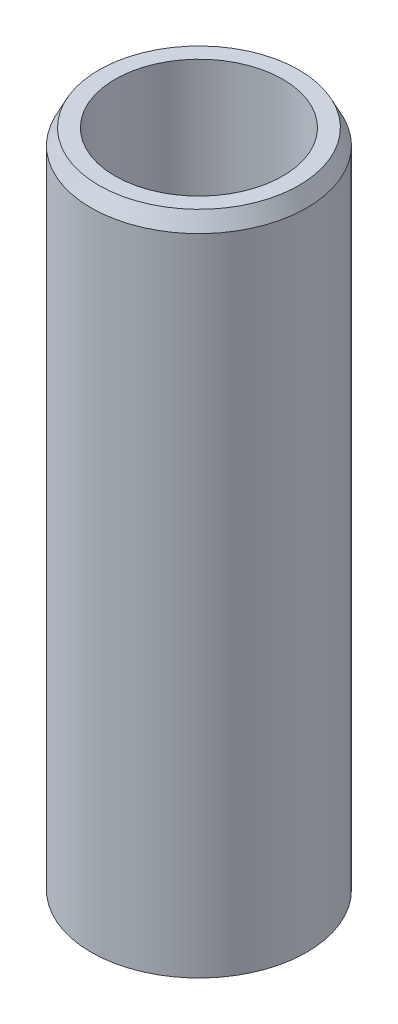
ISO-10303-21;
HEADER;
FILE_DESCRIPTION(('STEP AP214'),'2;1');
FILE_NAME('part.step','',(''),(''),'','','');
FILE_SCHEMA(('AUTOMOTIVE_DESIGN { 1 0 10303 214 1 1 1 1 }'));
ENDSEC;
DATA;
#1=APPLICATION_CONTEXT('core data for automotive mechanical design processes');
#2=APPLICATION_PROTOCOL_DEFINITION('international standard','automotive_design',2000,#1);
#3=PRODUCT_CONTEXT('',#1,'mechanical');
#4=PRODUCT('Part','Part','',(#3));
#5=PRODUCT_RELATED_PRODUCT_CATEGORY('part','',(#4));
#6=PRODUCT_DEFINITION_FORMATION('','',#4);
#7=PRODUCT_DEFINITION_CONTEXT('part definition',#1,'design');
#8=PRODUCT_DEFINITION('design','',#6,#7);
#9=PRODUCT_DEFINITION_SHAPE('','',#8);
#10=(LENGTH_UNIT() NAMED_UNIT(*) SI_UNIT(.MILLI.,.METRE.));
#11=(NAMED_UNIT(*) PLANE_ANGLE_UNIT() SI_UNIT($,.RADIAN.));
#12=(NAMED_UNIT(*) SI_UNIT($,.STERADIAN.) SOLID_ANGLE_UNIT());
#13=UNCERTAINTY_MEASURE_WITH_UNIT(LENGTH_MEASURE(1.E-05),#10,'distance_accuracy_value','');
#14=(GEOMETRIC_REPRESENTATION_CONTEXT(3) GLOBAL_UNCERTAINTY_ASSIGNED_CONTEXT((#13)) GLOBAL_UNIT_ASSIGNED_CONTEXT((#10,
#11,#12)) REPRESENTATION_CONTEXT('',''));
#15=CARTESIAN_POINT('',(0.,0.,0.));
#16=DIRECTION('',(0.,0.,1.));
#17=DIRECTION('',(1.,0.,0.));
#18=AXIS2_PLACEMENT_3D('',#15,#16,#17);
#19=CARTESIAN_POINT('',(0.,201.307233266644,0.));
#20=DIRECTION('',(0.,-1.,0.));
#21=DIRECTION('',(0.,0.,-1.));
#22=AXIS2_PLACEMENT_3D('',#19,#20,#21);
#23=CYLINDRICAL_SURFACE('',#22,32.5);
#24=CARTESIAN_POINT('',(0.,196.62116246147,0.));
#25=DIRECTION('',(0.,1.,0.));
#26=DIRECTION('',(0.,0.,1.));
#27=AXIS2_PLACEMENT_3D('',#24,#25,#26);
#28=CIRCLE('',#27,32.5);
#29=CARTESIAN_POINT('',(0.,196.62116246147,32.5));
#30=VERTEX_POINT('',#29);
#31=EDGE_CURVE('E50',#30,#30,#28,.F.);
#32=ORIENTED_EDGE('',*,*,#31,.T.);
#33=EDGE_LOOP('',(#32));
#34=FACE_BOUND('',#33,.T.);
#35=CARTESIAN_POINT('',(0.,2.35247517782441,0.));
#36=DIRECTION('',(0.,1.,0.));
#37=DIRECTION('',(0.,0.,1.));
#38=AXIS2_PLACEMENT_3D('',#35,#36,#37);
#39=CIRCLE('',#38,32.5);
#40=CARTESIAN_POINT('',(0.,2.35247517782441,32.5));
#41=VERTEX_POINT('',#40);
#42=EDGE_CURVE('E51',#41,#41,#39,.T.);
#43=ORIENTED_EDGE('',*,*,#42,.T.);
#44=EDGE_LOOP('',(#43));
#45=FACE_BOUND('',#44,.T.);
#46=ADVANCED_FACE('F39',(#34,#45),#23,.T.);
#47=CARTESIAN_POINT('',(0.,201.307233266644,0.));
#48=DIRECTION('',(0.,1.,0.));
#49=DIRECTION('',(0.,0.,1.));
#50=AXIS2_PLACEMENT_3D('',#47,#48,#49);
#51=PLANE('',#50);
#52=CARTESIAN_POINT('',(0.,201.307233266644,0.));
#53=DIRECTION('',(0.,1.,0.));
#54=DIRECTION('',(0.,0.,1.));
#55=AXIS2_PLACEMENT_3D('',#52,#53,#54);
#56=CIRCLE('',#55,30.1475248221756);
#57=CARTESIAN_POINT('',(0.,201.307233266644,30.1475248221756));
#58=VERTEX_POINT('',#57);
#59=EDGE_CURVE('E54',#58,#58,#56,.T.);
#60=ORIENTED_EDGE('',*,*,#59,.T.);
#61=EDGE_LOOP('',(#60));
#62=FACE_BOUND('',#61,.T.);
#63=CARTESIAN_POINT('',(0.,201.307233266644,0.));
#64=DIRECTION('',(0.,1.,0.));
#65=DIRECTION('',(0.,0.,1.));
#66=AXIS2_PLACEMENT_3D('',#63,#64,#65);
#67=CIRCLE('',#66,25.2720986081389);
#68=CARTESIAN_POINT('',(0.,201.307233266644,25.2720986081389));
#69=VERTEX_POINT('',#68);
#70=EDGE_CURVE('E58',#69,#69,#67,.T.);
#71=ORIENTED_EDGE('',*,*,#70,.F.);
#72=EDGE_LOOP('',(#71));
#73=FACE_BOUND('',#72,.T.);
#74=ADVANCED_FACE('F69',(#62,#73),#51,.T.);
#75=CARTESIAN_POINT('',(0.,0.,0.));
#76=DIRECTION('',(0.,1.,0.));
#77=DIRECTION('',(0.,0.,1.));
#78=AXIS2_PLACEMENT_3D('',#75,#76,#77);
#79=PLANE('',#78);
#80=CARTESIAN_POINT('',(0.,0.,0.));
#81=DIRECTION('',(0.,1.,0.));
#82=DIRECTION('',(0.,0.,1.));
#83=AXIS2_PLACEMENT_3D('',#80,#81,#82);
#84=CIRCLE('',#83,27.8139291948264);
#85=CARTESIAN_POINT('',(0.,0.,27.8139291948264));
#86=VERTEX_POINT('',#85);
#87=EDGE_CURVE('E10',#86,#86,#84,.F.);
#88=ORIENTED_EDGE('',*,*,#87,.T.);
#89=EDGE_LOOP('',(#88));
#90=FACE_BOUND('',#89,.T.);
#91=CARTESIAN_POINT('',(0.,0.,0.));
#92=DIRECTION('',(0.,1.,0.));
#93=DIRECTION('',(0.,0.,1.));
#94=AXIS2_PLACEMENT_3D('',#91,#92,#93);
#95=CIRCLE('',#94,25.2720986081389);
#96=CARTESIAN_POINT('',(0.,0.,25.2720986081389));
#97=VERTEX_POINT('',#96);
#98=EDGE_CURVE('E63',#97,#97,#95,.T.);
#99=ORIENTED_EDGE('',*,*,#98,.T.);
#100=EDGE_LOOP('',(#99));
#101=FACE_BOUND('',#100,.T.);
#102=ADVANCED_FACE('F75',(#90,#101),#79,.F.);
#103=CARTESIAN_POINT('',(0.,201.307233266644,0.));
#104=DIRECTION('',(0.,-1.,0.));
#105=DIRECTION('',(0.,0.,-1.));
#106=AXIS2_PLACEMENT_3D('',#103,#104,#105);
#107=CYLINDRICAL_SURFACE('',#106,25.2720986081389);
#108=ORIENTED_EDGE('',*,*,#70,.T.);
#109=EDGE_LOOP('',(#108));
#110=FACE_BOUND('',#109,.T.);
#111=ORIENTED_EDGE('',*,*,#98,.F.);
#112=EDGE_LOOP('',(#111));
#113=FACE_BOUND('',#112,.T.);
#114=ADVANCED_FACE('F70',(#110,#113),#107,.F.);
#115=CARTESIAN_POINT('',(0.,201.307233266644,0.));
#116=DIRECTION('',(0.,-1.,0.));
#117=DIRECTION('',(0.,0.,-1.));
#118=AXIS2_PLACEMENT_3D('',#115,#116,#117);
#119=CONICAL_SURFACE('',#118,30.1475248221756,0.465257856439914);
#120=ORIENTED_EDGE('',*,*,#31,.F.);
#121=EDGE_LOOP('',(#120));
#122=FACE_BOUND('',#121,.T.);
#123=ORIENTED_EDGE('',*,*,#59,.F.);
#124=EDGE_LOOP('',(#123));
#125=FACE_BOUND('',#124,.T.);
#126=ADVANCED_FACE('F81',(#122,#125),#119,.T.);
#127=CARTESIAN_POINT('',(0.,2.35247517782441,0.));
#128=DIRECTION('',(0.,1.,0.));
#129=DIRECTION('',(0.,0.,1.));
#130=AXIS2_PLACEMENT_3D('',#127,#128,#129);
#131=CONICAL_SURFACE('',#130,32.5,1.10553847035499);
#132=ORIENTED_EDGE('',*,*,#87,.F.);
#133=EDGE_LOOP('',(#132));
#134=FACE_BOUND('',#133,.T.);
#135=ORIENTED_EDGE('',*,*,#42,.F.);
#136=EDGE_LOOP('',(#135));
#137=FACE_BOUND('',#136,.T.);
#138=ADVANCED_FACE('F45',(#134,#137),#131,.T.);
#139=CLOSED_SHELL('',(#46,#74,#102,#114,#126,#138));
#140=MANIFOLD_SOLID_BREP('B2',#139);
#141=ADVANCED_BREP_SHAPE_REPRESENTATION('',(#18,#140),#14);
#142=SHAPE_DEFINITION_REPRESENTATION(#9,#141);
ENDSEC;
END-ISO-10303-21;
